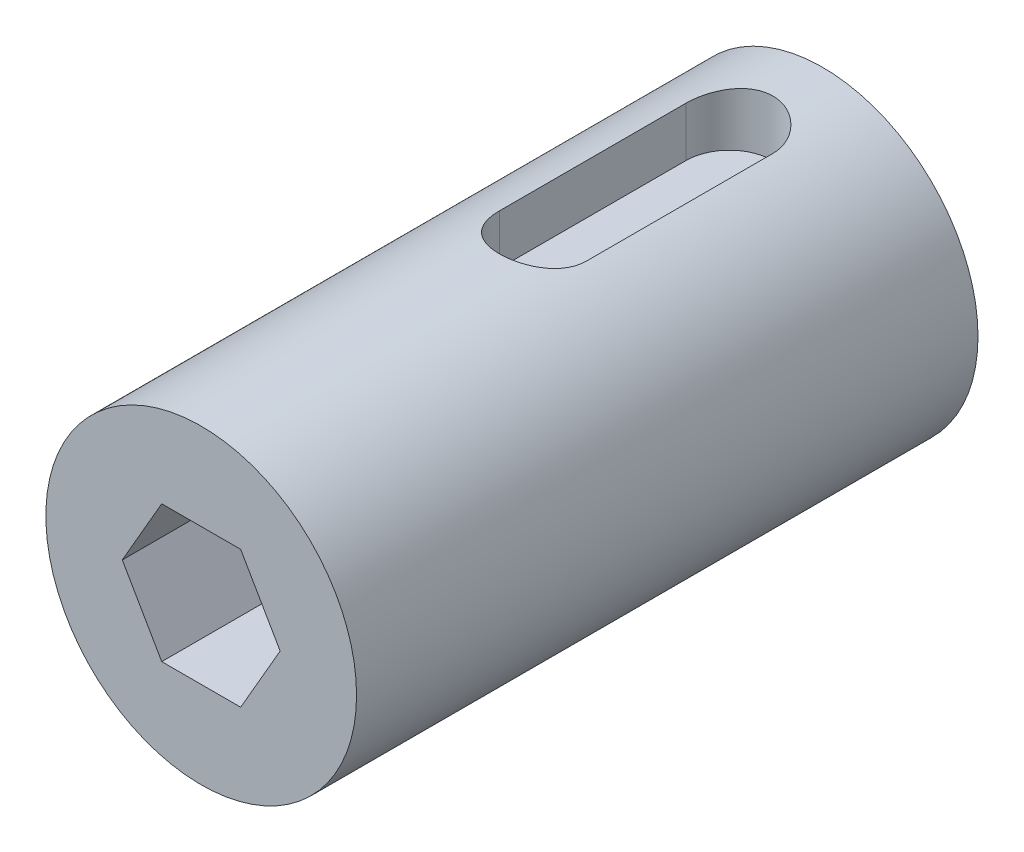
ISO-10303-21;
HEADER;
FILE_DESCRIPTION(('STEP AP214'),'2;1');
FILE_NAME('part.step','',(''),(''),'','','');
FILE_SCHEMA(('AUTOMOTIVE_DESIGN { 1 0 10303 214 1 1 1 1 }'));
ENDSEC;
DATA;
#1=APPLICATION_CONTEXT('core data for automotive mechanical design processes');
#2=APPLICATION_PROTOCOL_DEFINITION('international standard','automotive_design',2000,#1);
#3=PRODUCT_CONTEXT('',#1,'mechanical');
#4=PRODUCT('Part','Part','',(#3));
#5=PRODUCT_RELATED_PRODUCT_CATEGORY('part','',(#4));
#6=PRODUCT_DEFINITION_FORMATION('','',#4);
#7=PRODUCT_DEFINITION_CONTEXT('part definition',#1,'design');
#8=PRODUCT_DEFINITION('design','',#6,#7);
#9=PRODUCT_DEFINITION_SHAPE('','',#8);
#10=(LENGTH_UNIT() NAMED_UNIT(*) SI_UNIT(.MILLI.,.METRE.));
#11=(NAMED_UNIT(*) PLANE_ANGLE_UNIT() SI_UNIT($,.RADIAN.));
#12=(NAMED_UNIT(*) SI_UNIT($,.STERADIAN.) SOLID_ANGLE_UNIT());
#13=UNCERTAINTY_MEASURE_WITH_UNIT(LENGTH_MEASURE(1.E-05),#10,'distance_accuracy_value','');
#14=(GEOMETRIC_REPRESENTATION_CONTEXT(3) GLOBAL_UNCERTAINTY_ASSIGNED_CONTEXT((#13)) GLOBAL_UNIT_ASSIGNED_CONTEXT((#10,
#11,#12)) REPRESENTATION_CONTEXT('',''));
#15=CARTESIAN_POINT('',(0.,0.,0.));
#16=DIRECTION('',(0.,0.,1.));
#17=DIRECTION('',(1.,0.,0.));
#18=AXIS2_PLACEMENT_3D('',#15,#16,#17);
#19=CARTESIAN_POINT('',(0.,0.,50.));
#20=DIRECTION('',(0.,0.,-1.));
#21=DIRECTION('',(-1.,0.,0.));
#22=AXIS2_PLACEMENT_3D('',#19,#20,#21);
#23=CYLINDRICAL_SURFACE('',#22,12.5);
#24=DIRECTION('',(0.,0.,-1.));
#25=VECTOR('',#24,1.);
#26=CARTESIAN_POINT('',(-3.49999999999999,12.,50.));
#27=LINE('',#26,#25);
#28=CARTESIAN_POINT('',(-3.5,12.,22.5));
#29=VERTEX_POINT('',#28);
#30=CARTESIAN_POINT('',(-3.49999999999999,12.,7.50000000000001));
#31=VERTEX_POINT('',#30);
#32=EDGE_CURVE('E192',#29,#31,#27,.T.);
#33=ORIENTED_EDGE('',*,*,#32,.T.);
#34=CARTESIAN_POINT('',(-3.5,12.,7.5));
#35=CARTESIAN_POINT('',(-3.50001166350967,11.9999876705949,7.40363120633157));
#36=CARTESIAN_POINT('',(-3.49602008454055,12.0011605876877,7.30726965498061));
#37=CARTESIAN_POINT('',(-3.48012111799737,12.0057853642508,7.11527564459427));
#38=CARTESIAN_POINT('',(-3.46821531893777,12.0092367663908,7.019643043142));
#39=CARTESIAN_POINT('',(-3.43661484251092,12.0183165944652,6.83000028060051));
#40=CARTESIAN_POINT('',(-3.4169381121762,12.0239400034777,6.73598689837495));
#41=CARTESIAN_POINT('',(-3.36998455310924,12.0371838427044,6.55004672623406));
#42=CARTESIAN_POINT('',(-3.3427075659923,12.0448043145361,6.45811997984613));
#43=CARTESIAN_POINT('',(-3.24979595230662,12.0703357918097,6.18646979634341));
#44=CARTESIAN_POINT('',(-3.17304370909085,12.0909281609354,6.01065682126862));
#45=CARTESIAN_POINT('',(-2.99228455654647,12.1369220807837,5.67441822705576));
#46=CARTESIAN_POINT('',(-2.88826721789389,12.1623254707627,5.51399852823235));
#47=CARTESIAN_POINT('',(-2.65286192992722,12.2158593445383,5.20862976797053));
#48=CARTESIAN_POINT('',(-2.52085987489053,12.2440417892059,5.06416229364313));
#49=CARTESIAN_POINT('',(-2.234548993756,12.2995130977679,4.79909880919831));
#50=CARTESIAN_POINT('',(-2.08023650068627,12.3268018138618,4.67850673100649));
#51=CARTESIAN_POINT('',(-1.75028862723118,12.3779969978275,4.4625608782271));
#52=CARTESIAN_POINT('',(-1.5743226717299,12.4018346375004,4.3676944047712));
#53=CARTESIAN_POINT('',(-1.20816588177731,12.44283798037,4.20908541695663));
#54=CARTESIAN_POINT('',(-1.01797835860227,12.4600052309333,4.14533568339761));
#55=CARTESIAN_POINT('',(-0.633839106725809,12.4853655530832,4.05234674447457));
#56=CARTESIAN_POINT('',(-0.440101863159312,12.4937731728472,4.02228105622713));
#57=CARTESIAN_POINT('',(-0.0501587800539212,12.5014192551162,3.99490829859353));
#58=CARTESIAN_POINT('',(0.146046653154887,12.5006592076311,3.99759590585428));
#59=CARTESIAN_POINT('',(0.529578150858038,12.490210292546,4.03508324777198));
#60=CARTESIAN_POINT('',(0.71699945381099,12.4807701122057,4.06898862453682));
#61=CARTESIAN_POINT('',(1.08337543967265,12.4543186233204,4.16649733203143));
#62=CARTESIAN_POINT('',(1.26232970193591,12.4373069390564,4.23010213653626));
#63=CARTESIAN_POINT('',(1.60891788260237,12.3972645563904,4.38585983939746));
#64=CARTESIAN_POINT('',(1.77641088666597,12.3741716643477,4.47830965999798));
#65=CARTESIAN_POINT('',(2.09380019580591,12.3244409728652,4.68889802545429));
#66=CARTESIAN_POINT('',(2.24369306934008,12.2978024842844,4.80704156711547));
#67=CARTESIAN_POINT('',(2.52695740448666,12.2427948753304,5.07036788470289));
#68=CARTESIAN_POINT('',(2.65960312261849,12.2143976827231,5.21632680512761));
#69=CARTESIAN_POINT('',(2.89874532984003,12.1598666654995,5.52870404096098));
#70=CARTESIAN_POINT('',(3.005234468535,12.1337334784354,5.69512808770843));
#71=CARTESIAN_POINT('',(3.18971511089517,12.0865596947691,6.04563874553348));
#72=CARTESIAN_POINT('',(3.26747417701919,12.0655610810481,6.22985483311083));
#73=CARTESIAN_POINT('',(3.35980107171212,12.0400464840366,6.51424667577773));
#74=CARTESIAN_POINT('',(3.386522463508,12.0325395484738,6.61037284339986));
#75=CARTESIAN_POINT('',(3.43168497550142,12.0197378346154,6.80468320276906));
#76=CARTESIAN_POINT('',(3.4501299387698,12.0144420296844,6.90286641713439));
#77=CARTESIAN_POINT('',(3.47621425920341,12.0069184721787,7.08420389645613));
#78=CARTESIAN_POINT('',(3.48513505897352,12.0043284784931,7.16716238691241));
#79=CARTESIAN_POINT('',(3.49702599621912,12.0008673568444,7.33341095210182));
#80=CARTESIAN_POINT('',(3.50000532139007,11.9999935750209,7.41670031500233));
#81=CARTESIAN_POINT('',(3.5,12.,7.5));
#82=B_SPLINE_CURVE_WITH_KNOTS('',3,(#34,#35,#36,#37,#38,#39,#40,#41,#42,#43,#44,#45,#46,#47,#48,
#49,#50,#51,#52,#53,#54,#55,#56,#57,#58,#59,#60,#61,#62,#63,#64,#65,#66,#67,#68,#69,#70,#71,#72,
#73,#74,#75,#76,#77,#78,#79,#80,#81),.UNSPECIFIED.,.F.,.F.,(4,2,2,2,2,2,2,2,2,2,2,2,2,2,2,2,2,2,
2,2,2,2,2,4),(0.,0.289004217516944,0.577950444630684,0.866233214179514,1.15452199181451,
1.73043904740552,2.30657672254681,2.89698418267647,3.4874887934762,4.08850140557697,
4.68937451414314,5.27515742474232,5.86084513003096,6.43025863858999,6.99970040616554,
7.57520880715008,8.15082923080041,8.74582081533595,9.34097941071209,9.9408527779928,
10.2406952834135,10.5403984157368,10.790607208484,11.0404287858598),.UNSPECIFIED.);
#83=CARTESIAN_POINT('',(3.5,12.,7.5));
#84=VERTEX_POINT('',#83);
#85=EDGE_CURVE('E11',#31,#84,#82,.T.);
#86=ORIENTED_EDGE('',*,*,#85,.T.);
#87=DIRECTION('',(0.,0.,-1.));
#88=VECTOR('',#87,1.);
#89=CARTESIAN_POINT('',(3.50000000000001,12.,50.));
#90=LINE('',#89,#88);
#91=CARTESIAN_POINT('',(3.5,12.,22.5));
#92=VERTEX_POINT('',#91);
#93=EDGE_CURVE('E44',#84,#92,#90,.F.);
#94=ORIENTED_EDGE('',*,*,#93,.T.);
#95=CARTESIAN_POINT('',(3.5,12.,22.5));
#96=CARTESIAN_POINT('',(3.50001166350967,11.9999876705949,22.5963687936684));
#97=CARTESIAN_POINT('',(3.49602008454055,12.0011605876877,22.6927303450194));
#98=CARTESIAN_POINT('',(3.48012111799737,12.0057853642508,22.8847243554057));
#99=CARTESIAN_POINT('',(3.46821531893777,12.0092367663908,22.980356956858));
#100=CARTESIAN_POINT('',(3.43661484251092,12.0183165944652,23.1699997193995));
#101=CARTESIAN_POINT('',(3.4169381121762,12.0239400034777,23.2640131016251));
#102=CARTESIAN_POINT('',(3.36998455310924,12.0371838427044,23.4499532737659));
#103=CARTESIAN_POINT('',(3.3427075659923,12.0448043145361,23.5418800201539));
#104=CARTESIAN_POINT('',(3.24979595230662,12.0703357918097,23.8135302036566));
#105=CARTESIAN_POINT('',(3.17304370909085,12.0909281609354,23.9893431787314));
#106=CARTESIAN_POINT('',(2.99228455654647,12.1369220807837,24.3255817729442));
#107=CARTESIAN_POINT('',(2.88826721789389,12.1623254707627,24.4860014717677));
#108=CARTESIAN_POINT('',(2.65286192992722,12.2158593445383,24.7913702320295));
#109=CARTESIAN_POINT('',(2.52085987489053,12.2440417892059,24.9358377063569));
#110=CARTESIAN_POINT('',(2.234548993756,12.2995130977679,25.2009011908017));
#111=CARTESIAN_POINT('',(2.08023650068627,12.3268018138618,25.3214932689935));
#112=CARTESIAN_POINT('',(1.75028862723118,12.3779969978275,25.5374391217729));
#113=CARTESIAN_POINT('',(1.5743226717299,12.4018346375004,25.6323055952288));
#114=CARTESIAN_POINT('',(1.20816588177731,12.44283798037,25.7909145830434));
#115=CARTESIAN_POINT('',(1.01797835860227,12.4600052309333,25.8546643166024));
#116=CARTESIAN_POINT('',(0.633839106725811,12.4853655530832,25.9476532555254));
#117=CARTESIAN_POINT('',(0.440101863159313,12.4937731728472,25.9777189437729));
#118=CARTESIAN_POINT('',(0.0501587800539223,12.5014192551162,26.0050917014065));
#119=CARTESIAN_POINT('',(-0.146046653154886,12.5006592076311,26.0024040941457));
#120=CARTESIAN_POINT('',(-0.529578150858037,12.490210292546,25.964916752228));
#121=CARTESIAN_POINT('',(-0.716999453810989,12.4807701122057,25.9310113754632));
#122=CARTESIAN_POINT('',(-1.08337543967265,12.4543186233204,25.8335026679686));
#123=CARTESIAN_POINT('',(-1.26232970193591,12.4373069390564,25.7698978634637));
#124=CARTESIAN_POINT('',(-1.60891788260237,12.3972645563904,25.6141401606025));
#125=CARTESIAN_POINT('',(-1.77641088666597,12.3741716643477,25.521690340002));
#126=CARTESIAN_POINT('',(-2.09380019580591,12.3244409728652,25.3111019745457));
#127=CARTESIAN_POINT('',(-2.24369306934008,12.2978024842844,25.1929584328845));
#128=CARTESIAN_POINT('',(-2.52695740448666,12.2427948753304,24.9296321152971));
#129=CARTESIAN_POINT('',(-2.65960312261848,12.2143976827231,24.7836731948724));
#130=CARTESIAN_POINT('',(-2.89874532984003,12.1598666654995,24.471295959039));
#131=CARTESIAN_POINT('',(-3.005234468535,12.1337334784354,24.3048719122916));
#132=CARTESIAN_POINT('',(-3.18971511089517,12.0865596947691,23.9543612544665));
#133=CARTESIAN_POINT('',(-3.26747417701919,12.0655610810481,23.7701451668892));
#134=CARTESIAN_POINT('',(-3.35980107171212,12.0400464840366,23.4857533242223));
#135=CARTESIAN_POINT('',(-3.386522463508,12.0325395484738,23.3896271566001));
#136=CARTESIAN_POINT('',(-3.43168497550142,12.0197378346154,23.1953167972309));
#137=CARTESIAN_POINT('',(-3.4501299387698,12.0144420296844,23.0971335828656));
#138=CARTESIAN_POINT('',(-3.47621425920341,12.0069184721787,22.9157961035439));
#139=CARTESIAN_POINT('',(-3.48513505897352,12.0043284784931,22.8328376130876));
#140=CARTESIAN_POINT('',(-3.49702599621912,12.0008673568444,22.6665890478982));
#141=CARTESIAN_POINT('',(-3.50000532139007,11.9999935750209,22.5832996849977));
#142=CARTESIAN_POINT('',(-3.5,12.,22.5));
#143=B_SPLINE_CURVE_WITH_KNOTS('',3,(#95,#96,#97,#98,#99,#100,#101,#102,#103,#104,#105,#106,
#107,#108,#109,#110,#111,#112,#113,#114,#115,#116,#117,#118,#119,#120,#121,#122,#123,#124,#125,
#126,#127,#128,#129,#130,#131,#132,#133,#134,#135,#136,#137,#138,#139,#140,#141,#142),
.UNSPECIFIED.,.F.,.F.,(4,2,2,2,2,2,2,2,2,2,2,2,2,2,2,2,2,2,2,2,2,2,2,4),(0.,0.289004217516944,
0.577950444630686,0.866233214179513,1.15452199181451,1.73043904740551,2.30657672254681,
2.89698418267647,3.4874887934762,4.08850140557697,4.68937451414314,5.27515742474232,
5.86084513003096,6.43025863858999,6.99970040616554,7.57520880715007,8.15082923080041,
8.74582081533595,9.34097941071209,9.9408527779928,10.2406952834135,10.5403984157368,
10.790607208484,11.0404287858598),.UNSPECIFIED.);
#144=EDGE_CURVE('E196',#92,#29,#143,.T.);
#145=ORIENTED_EDGE('',*,*,#144,.T.);
#146=EDGE_LOOP('',(#33,#86,#94,#145));
#147=FACE_BOUND('',#146,.T.);
#148=CARTESIAN_POINT('',(0.,0.,50.));
#149=DIRECTION('',(0.,0.,1.));
#150=DIRECTION('',(1.,0.,0.));
#151=AXIS2_PLACEMENT_3D('',#148,#149,#150);
#152=CIRCLE('',#151,12.5);
#153=CARTESIAN_POINT('',(12.5,0.,50.));
#154=VERTEX_POINT('',#153);
#155=EDGE_CURVE('E189',#154,#154,#152,.T.);
#156=ORIENTED_EDGE('',*,*,#155,.F.);
#157=EDGE_LOOP('',(#156));
#158=FACE_BOUND('',#157,.T.);
#159=CARTESIAN_POINT('',(0.,0.,0.));
#160=DIRECTION('',(0.,0.,1.));
#161=DIRECTION('',(1.,0.,0.));
#162=AXIS2_PLACEMENT_3D('',#159,#160,#161);
#163=CIRCLE('',#162,12.5);
#164=CARTESIAN_POINT('',(12.5,0.,0.));
#165=VERTEX_POINT('',#164);
#166=EDGE_CURVE('E179',#165,#165,#163,.T.);
#167=ORIENTED_EDGE('',*,*,#166,.T.);
#168=EDGE_LOOP('',(#167));
#169=FACE_BOUND('',#168,.T.);
#170=ADVANCED_FACE('F32',(#147,#158,#169),#23,.T.);
#171=CARTESIAN_POINT('',(0.,0.,50.));
#172=DIRECTION('',(0.,0.,1.));
#173=DIRECTION('',(1.,0.,0.));
#174=AXIS2_PLACEMENT_3D('',#171,#172,#173);
#175=PLANE('',#174);
#176=DIRECTION('',(-1.,0.,0.));
#177=VECTOR('',#176,1.);
#178=CARTESIAN_POINT('',(3.17542648054294,5.5,50.));
#179=LINE('',#178,#177);
#180=CARTESIAN_POINT('',(3.17542648054294,5.5,50.));
#181=VERTEX_POINT('',#180);
#182=CARTESIAN_POINT('',(-3.17542648054294,5.5,50.));
#183=VERTEX_POINT('',#182);
#184=EDGE_CURVE('E59',#181,#183,#179,.T.);
#185=ORIENTED_EDGE('',*,*,#184,.F.);
#186=DIRECTION('',(-0.5,0.866025403784439,0.));
#187=VECTOR('',#186,1.);
#188=CARTESIAN_POINT('',(6.35085296108589,0.,50.));
#189=LINE('',#188,#187);
#190=CARTESIAN_POINT('',(6.35085296108589,0.,50.));
#191=VERTEX_POINT('',#190);
#192=EDGE_CURVE('E146',#191,#181,#189,.T.);
#193=ORIENTED_EDGE('',*,*,#192,.F.);
#194=DIRECTION('',(0.5,0.866025403784438,0.));
#195=VECTOR('',#194,1.);
#196=CARTESIAN_POINT('',(3.17542648054294,-5.5,50.));
#197=LINE('',#196,#195);
#198=CARTESIAN_POINT('',(3.17542648054294,-5.5,50.));
#199=VERTEX_POINT('',#198);
#200=EDGE_CURVE('E172',#199,#191,#197,.T.);
#201=ORIENTED_EDGE('',*,*,#200,.F.);
#202=DIRECTION('',(1.,0.,0.));
#203=VECTOR('',#202,1.);
#204=CARTESIAN_POINT('',(-3.17542648054294,-5.5,50.));
#205=LINE('',#204,#203);
#206=CARTESIAN_POINT('',(-3.17542648054294,-5.5,50.));
#207=VERTEX_POINT('',#206);
#208=EDGE_CURVE('E169',#207,#199,#205,.T.);
#209=ORIENTED_EDGE('',*,*,#208,.F.);
#210=DIRECTION('',(0.5,-0.866025403784439,0.));
#211=VECTOR('',#210,1.);
#212=CARTESIAN_POINT('',(-6.35085296108588,0.,50.));
#213=LINE('',#212,#211);
#214=CARTESIAN_POINT('',(-6.35085296108588,0.,50.));
#215=VERTEX_POINT('',#214);
#216=EDGE_CURVE('E166',#215,#207,#213,.T.);
#217=ORIENTED_EDGE('',*,*,#216,.F.);
#218=DIRECTION('',(-0.5,-0.866025403784439,0.));
#219=VECTOR('',#218,1.);
#220=CARTESIAN_POINT('',(-3.17542648054294,5.5,50.));
#221=LINE('',#220,#219);
#222=EDGE_CURVE('E163',#183,#215,#221,.T.);
#223=ORIENTED_EDGE('',*,*,#222,.F.);
#224=EDGE_LOOP('',(#185,#193,#201,#209,#217,#223));
#225=FACE_BOUND('',#224,.T.);
#226=ORIENTED_EDGE('',*,*,#155,.T.);
#227=EDGE_LOOP('',(#226));
#228=FACE_BOUND('',#227,.T.);
#229=ADVANCED_FACE('F242',(#225,#228),#175,.T.);
#230=CARTESIAN_POINT('',(0.,0.,0.));
#231=DIRECTION('',(0.,0.,1.));
#232=DIRECTION('',(1.,0.,0.));
#233=AXIS2_PLACEMENT_3D('',#230,#231,#232);
#234=PLANE('',#233);
#235=ORIENTED_EDGE('',*,*,#166,.F.);
#236=EDGE_LOOP('',(#235));
#237=FACE_BOUND('',#236,.T.);
#238=ADVANCED_FACE('F241',(#237),#234,.F.);
#239=CARTESIAN_POINT('',(3.17542648054294,5.5,35.));
#240=DIRECTION('',(0.,1.,0.));
#241=DIRECTION('',(0.,0.,1.));
#242=AXIS2_PLACEMENT_3D('',#239,#240,#241);
#243=PLANE('',#242);
#244=ORIENTED_EDGE('',*,*,#184,.T.);
#245=DIRECTION('',(0.,0.,1.));
#246=VECTOR('',#245,1.);
#247=CARTESIAN_POINT('',(-3.17542648054294,5.5,35.));
#248=LINE('',#247,#246);
#249=CARTESIAN_POINT('',(-3.17542648054294,5.5,35.));
#250=VERTEX_POINT('',#249);
#251=EDGE_CURVE('E161',#250,#183,#248,.T.);
#252=ORIENTED_EDGE('',*,*,#251,.F.);
#253=DIRECTION('',(-1.,0.,0.));
#254=VECTOR('',#253,1.);
#255=CARTESIAN_POINT('',(3.17542648054294,5.5,35.));
#256=LINE('',#255,#254);
#257=CARTESIAN_POINT('',(3.17542648054294,5.5,35.));
#258=VERTEX_POINT('',#257);
#259=EDGE_CURVE('E142',#258,#250,#256,.T.);
#260=ORIENTED_EDGE('',*,*,#259,.F.);
#261=DIRECTION('',(0.,0.,1.));
#262=VECTOR('',#261,1.);
#263=CARTESIAN_POINT('',(3.17542648054294,5.5,35.));
#264=LINE('',#263,#262);
#265=EDGE_CURVE('E177',#258,#181,#264,.T.);
#266=ORIENTED_EDGE('',*,*,#265,.T.);
#267=EDGE_LOOP('',(#244,#252,#260,#266));
#268=FACE_BOUND('',#267,.T.);
#269=ADVANCED_FACE('F223',(#268),#243,.F.);
#270=CARTESIAN_POINT('',(6.35085296108589,0.,35.));
#271=DIRECTION('',(0.866025403784439,0.5,0.));
#272=DIRECTION('',(-0.5,0.866025403784439,0.));
#273=AXIS2_PLACEMENT_3D('',#270,#271,#272);
#274=PLANE('',#273);
#275=ORIENTED_EDGE('',*,*,#192,.T.);
#276=ORIENTED_EDGE('',*,*,#265,.F.);
#277=DIRECTION('',(-0.5,0.866025403784439,0.));
#278=VECTOR('',#277,1.);
#279=CARTESIAN_POINT('',(6.35085296108589,0.,35.));
#280=LINE('',#279,#278);
#281=CARTESIAN_POINT('',(6.35085296108589,0.,35.));
#282=VERTEX_POINT('',#281);
#283=EDGE_CURVE('E158',#282,#258,#280,.T.);
#284=ORIENTED_EDGE('',*,*,#283,.F.);
#285=DIRECTION('',(0.,0.,1.));
#286=VECTOR('',#285,1.);
#287=CARTESIAN_POINT('',(6.35085296108589,0.,35.));
#288=LINE('',#287,#286);
#289=EDGE_CURVE('E180',#282,#191,#288,.T.);
#290=ORIENTED_EDGE('',*,*,#289,.T.);
#291=EDGE_LOOP('',(#275,#276,#284,#290));
#292=FACE_BOUND('',#291,.T.);
#293=ADVANCED_FACE('F219',(#292),#274,.F.);
#294=CARTESIAN_POINT('',(3.17542648054294,-5.5,35.));
#295=DIRECTION('',(0.866025403784438,-0.5,0.));
#296=DIRECTION('',(0.5,0.866025403784439,0.));
#297=AXIS2_PLACEMENT_3D('',#294,#295,#296);
#298=PLANE('',#297);
#299=ORIENTED_EDGE('',*,*,#200,.T.);
#300=ORIENTED_EDGE('',*,*,#289,.F.);
#301=DIRECTION('',(0.5,0.866025403784438,0.));
#302=VECTOR('',#301,1.);
#303=CARTESIAN_POINT('',(3.17542648054294,-5.5,35.));
#304=LINE('',#303,#302);
#305=CARTESIAN_POINT('',(3.17542648054294,-5.5,35.));
#306=VERTEX_POINT('',#305);
#307=EDGE_CURVE('E155',#306,#282,#304,.T.);
#308=ORIENTED_EDGE('',*,*,#307,.F.);
#309=DIRECTION('',(0.,0.,1.));
#310=VECTOR('',#309,1.);
#311=CARTESIAN_POINT('',(3.17542648054294,-5.5,35.));
#312=LINE('',#311,#310);
#313=EDGE_CURVE('E182',#306,#199,#312,.T.);
#314=ORIENTED_EDGE('',*,*,#313,.T.);
#315=EDGE_LOOP('',(#299,#300,#308,#314));
#316=FACE_BOUND('',#315,.T.);
#317=ADVANCED_FACE('F222',(#316),#298,.F.);
#318=CARTESIAN_POINT('',(-3.17542648054294,-5.5,35.));
#319=DIRECTION('',(0.,-1.,0.));
#320=DIRECTION('',(0.,0.,-1.));
#321=AXIS2_PLACEMENT_3D('',#318,#319,#320);
#322=PLANE('',#321);
#323=ORIENTED_EDGE('',*,*,#208,.T.);
#324=ORIENTED_EDGE('',*,*,#313,.F.);
#325=DIRECTION('',(1.,0.,0.));
#326=VECTOR('',#325,1.);
#327=CARTESIAN_POINT('',(-3.17542648054294,-5.5,35.));
#328=LINE('',#327,#326);
#329=CARTESIAN_POINT('',(-3.17542648054294,-5.5,35.));
#330=VERTEX_POINT('',#329);
#331=EDGE_CURVE('E152',#330,#306,#328,.T.);
#332=ORIENTED_EDGE('',*,*,#331,.F.);
#333=DIRECTION('',(0.,0.,1.));
#334=VECTOR('',#333,1.);
#335=CARTESIAN_POINT('',(-3.17542648054294,-5.5,35.));
#336=LINE('',#335,#334);
#337=EDGE_CURVE('E184',#330,#207,#336,.T.);
#338=ORIENTED_EDGE('',*,*,#337,.T.);
#339=EDGE_LOOP('',(#323,#324,#332,#338));
#340=FACE_BOUND('',#339,.T.);
#341=ADVANCED_FACE('F227',(#340),#322,.F.);
#342=CARTESIAN_POINT('',(-6.35085296108588,0.,35.));
#343=DIRECTION('',(-0.866025403784439,-0.5,0.));
#344=DIRECTION('',(0.5,-0.866025403784439,0.));
#345=AXIS2_PLACEMENT_3D('',#342,#343,#344);
#346=PLANE('',#345);
#347=ORIENTED_EDGE('',*,*,#216,.T.);
#348=ORIENTED_EDGE('',*,*,#337,.F.);
#349=DIRECTION('',(0.5,-0.866025403784439,0.));
#350=VECTOR('',#349,1.);
#351=CARTESIAN_POINT('',(-6.35085296108588,0.,35.));
#352=LINE('',#351,#350);
#353=CARTESIAN_POINT('',(-6.35085296108588,0.,35.));
#354=VERTEX_POINT('',#353);
#355=EDGE_CURVE('E149',#354,#330,#352,.T.);
#356=ORIENTED_EDGE('',*,*,#355,.F.);
#357=DIRECTION('',(0.,0.,1.));
#358=VECTOR('',#357,1.);
#359=CARTESIAN_POINT('',(-6.35085296108588,0.,35.));
#360=LINE('',#359,#358);
#361=EDGE_CURVE('E186',#354,#215,#360,.T.);
#362=ORIENTED_EDGE('',*,*,#361,.T.);
#363=EDGE_LOOP('',(#347,#348,#356,#362));
#364=FACE_BOUND('',#363,.T.);
#365=ADVANCED_FACE('F231',(#364),#346,.F.);
#366=CARTESIAN_POINT('',(-3.17542648054294,5.5,35.));
#367=DIRECTION('',(-0.866025403784439,0.5,0.));
#368=DIRECTION('',(-0.5,-0.866025403784439,0.));
#369=AXIS2_PLACEMENT_3D('',#366,#367,#368);
#370=PLANE('',#369);
#371=ORIENTED_EDGE('',*,*,#222,.T.);
#372=ORIENTED_EDGE('',*,*,#361,.F.);
#373=DIRECTION('',(-0.5,-0.866025403784439,0.));
#374=VECTOR('',#373,1.);
#375=CARTESIAN_POINT('',(-3.17542648054294,5.5,35.));
#376=LINE('',#375,#374);
#377=EDGE_CURVE('E145',#250,#354,#376,.T.);
#378=ORIENTED_EDGE('',*,*,#377,.F.);
#379=ORIENTED_EDGE('',*,*,#251,.T.);
#380=EDGE_LOOP('',(#371,#372,#378,#379));
#381=FACE_BOUND('',#380,.T.);
#382=ADVANCED_FACE('F217',(#381),#370,.F.);
#383=CARTESIAN_POINT('',(-3.17542648054294,5.5,35.));
#384=DIRECTION('',(0.,0.,1.));
#385=DIRECTION('',(1.,0.,0.));
#386=AXIS2_PLACEMENT_3D('',#383,#384,#385);
#387=PLANE('',#386);
#388=ORIENTED_EDGE('',*,*,#259,.T.);
#389=ORIENTED_EDGE('',*,*,#377,.T.);
#390=ORIENTED_EDGE('',*,*,#355,.T.);
#391=ORIENTED_EDGE('',*,*,#331,.T.);
#392=ORIENTED_EDGE('',*,*,#307,.T.);
#393=ORIENTED_EDGE('',*,*,#283,.T.);
#394=EDGE_LOOP('',(#388,#389,#390,#391,#392,#393));
#395=FACE_BOUND('',#394,.T.);
#396=ADVANCED_FACE('F214',(#395),#387,.T.);
#397=CARTESIAN_POINT('',(0.,8.,7.5));
#398=DIRECTION('',(0.,1.,0.));
#399=DIRECTION('',(0.,0.,1.));
#400=AXIS2_PLACEMENT_3D('',#397,#398,#399);
#401=CYLINDRICAL_SURFACE('',#400,3.5);
#402=DIRECTION('',(0.,1.,0.));
#403=VECTOR('',#402,1.);
#404=CARTESIAN_POINT('',(-3.5,8.,7.5));
#405=LINE('',#404,#403);
#406=CARTESIAN_POINT('',(-3.5,8.,7.5));
#407=VERTEX_POINT('',#406);
#408=EDGE_CURVE('E51',#407,#31,#405,.T.);
#409=ORIENTED_EDGE('',*,*,#408,.F.);
#410=CARTESIAN_POINT('',(0.,8.,7.5));
#411=DIRECTION('',(0.,1.,0.));
#412=DIRECTION('',(0.,0.,1.));
#413=AXIS2_PLACEMENT_3D('',#410,#411,#412);
#414=CIRCLE('',#413,3.5);
#415=CARTESIAN_POINT('',(3.5,8.,7.5));
#416=VERTEX_POINT('',#415);
#417=EDGE_CURVE('E115',#416,#407,#414,.T.);
#418=ORIENTED_EDGE('',*,*,#417,.F.);
#419=DIRECTION('',(0.,1.,0.));
#420=VECTOR('',#419,1.);
#421=CARTESIAN_POINT('',(3.5,8.,7.5));
#422=LINE('',#421,#420);
#423=EDGE_CURVE('E136',#416,#84,#422,.T.);
#424=ORIENTED_EDGE('',*,*,#423,.T.);
#425=ORIENTED_EDGE('',*,*,#85,.F.);
#426=EDGE_LOOP('',(#409,#418,#424,#425));
#427=FACE_BOUND('',#426,.T.);
#428=ADVANCED_FACE('F112',(#427),#401,.F.);
#429=CARTESIAN_POINT('',(3.5,8.,7.5));
#430=DIRECTION('',(1.,0.,0.));
#431=DIRECTION('',(0.,0.,-1.));
#432=AXIS2_PLACEMENT_3D('',#429,#430,#431);
#433=PLANE('',#432);
#434=ORIENTED_EDGE('',*,*,#423,.F.);
#435=DIRECTION('',(0.,0.,-1.));
#436=VECTOR('',#435,1.);
#437=CARTESIAN_POINT('',(3.5,8.,7.5));
#438=LINE('',#437,#436);
#439=CARTESIAN_POINT('',(3.5,8.,22.5));
#440=VERTEX_POINT('',#439);
#441=EDGE_CURVE('E119',#440,#416,#438,.T.);
#442=ORIENTED_EDGE('',*,*,#441,.F.);
#443=DIRECTION('',(0.,1.,0.));
#444=VECTOR('',#443,1.);
#445=CARTESIAN_POINT('',(3.5,8.,22.5));
#446=LINE('',#445,#444);
#447=EDGE_CURVE('E138',#440,#92,#446,.T.);
#448=ORIENTED_EDGE('',*,*,#447,.T.);
#449=ORIENTED_EDGE('',*,*,#93,.F.);
#450=EDGE_LOOP('',(#434,#442,#448,#449));
#451=FACE_BOUND('',#450,.T.);
#452=ADVANCED_FACE('F207',(#451),#433,.F.);
#453=CARTESIAN_POINT('',(0.,8.,22.5));
#454=DIRECTION('',(0.,1.,0.));
#455=DIRECTION('',(0.,0.,1.));
#456=AXIS2_PLACEMENT_3D('',#453,#454,#455);
#457=CYLINDRICAL_SURFACE('',#456,3.5);
#458=ORIENTED_EDGE('',*,*,#447,.F.);
#459=CARTESIAN_POINT('',(0.,8.,22.5));
#460=DIRECTION('',(0.,1.,0.));
#461=DIRECTION('',(0.,0.,1.));
#462=AXIS2_PLACEMENT_3D('',#459,#460,#461);
#463=CIRCLE('',#462,3.5);
#464=CARTESIAN_POINT('',(-3.5,8.,22.5));
#465=VERTEX_POINT('',#464);
#466=EDGE_CURVE('E128',#465,#440,#463,.T.);
#467=ORIENTED_EDGE('',*,*,#466,.F.);
#468=DIRECTION('',(0.,1.,0.));
#469=VECTOR('',#468,1.);
#470=CARTESIAN_POINT('',(-3.5,8.,22.5));
#471=LINE('',#470,#469);
#472=EDGE_CURVE('E118',#465,#29,#471,.T.);
#473=ORIENTED_EDGE('',*,*,#472,.T.);
#474=ORIENTED_EDGE('',*,*,#144,.F.);
#475=EDGE_LOOP('',(#458,#467,#473,#474));
#476=FACE_BOUND('',#475,.T.);
#477=ADVANCED_FACE('F202',(#476),#457,.F.);
#478=CARTESIAN_POINT('',(-3.5,8.,7.5));
#479=DIRECTION('',(-1.,0.,0.));
#480=DIRECTION('',(0.,0.,1.));
#481=AXIS2_PLACEMENT_3D('',#478,#479,#480);
#482=PLANE('',#481);
#483=ORIENTED_EDGE('',*,*,#472,.F.);
#484=DIRECTION('',(0.,0.,1.));
#485=VECTOR('',#484,1.);
#486=CARTESIAN_POINT('',(-3.5,8.,7.5));
#487=LINE('',#486,#485);
#488=EDGE_CURVE('E122',#407,#465,#487,.T.);
#489=ORIENTED_EDGE('',*,*,#488,.F.);
#490=ORIENTED_EDGE('',*,*,#408,.T.);
#491=ORIENTED_EDGE('',*,*,#32,.F.);
#492=EDGE_LOOP('',(#483,#489,#490,#491));
#493=FACE_BOUND('',#492,.T.);
#494=ADVANCED_FACE('F123',(#493),#482,.F.);
#495=CARTESIAN_POINT('',(0.,8.,7.5));
#496=DIRECTION('',(0.,1.,0.));
#497=DIRECTION('',(0.,0.,1.));
#498=AXIS2_PLACEMENT_3D('',#495,#496,#497);
#499=PLANE('',#498);
#500=ORIENTED_EDGE('',*,*,#417,.T.);
#501=ORIENTED_EDGE('',*,*,#488,.T.);
#502=ORIENTED_EDGE('',*,*,#466,.T.);
#503=ORIENTED_EDGE('',*,*,#441,.T.);
#504=EDGE_LOOP('',(#500,#501,#502,#503));
#505=FACE_BOUND('',#504,.T.);
#506=ADVANCED_FACE('F130',(#505),#499,.T.);
#507=CLOSED_SHELL('',(#170,#229,#238,#269,#293,#317,#341,#365,#382,#396,#428,#452,#477,#494,#506));
#508=MANIFOLD_SOLID_BREP('B2',#507);
#509=ADVANCED_BREP_SHAPE_REPRESENTATION('',(#18,#508),#14);
#510=SHAPE_DEFINITION_REPRESENTATION(#9,#509);
ENDSEC;
END-ISO-10303-21;
